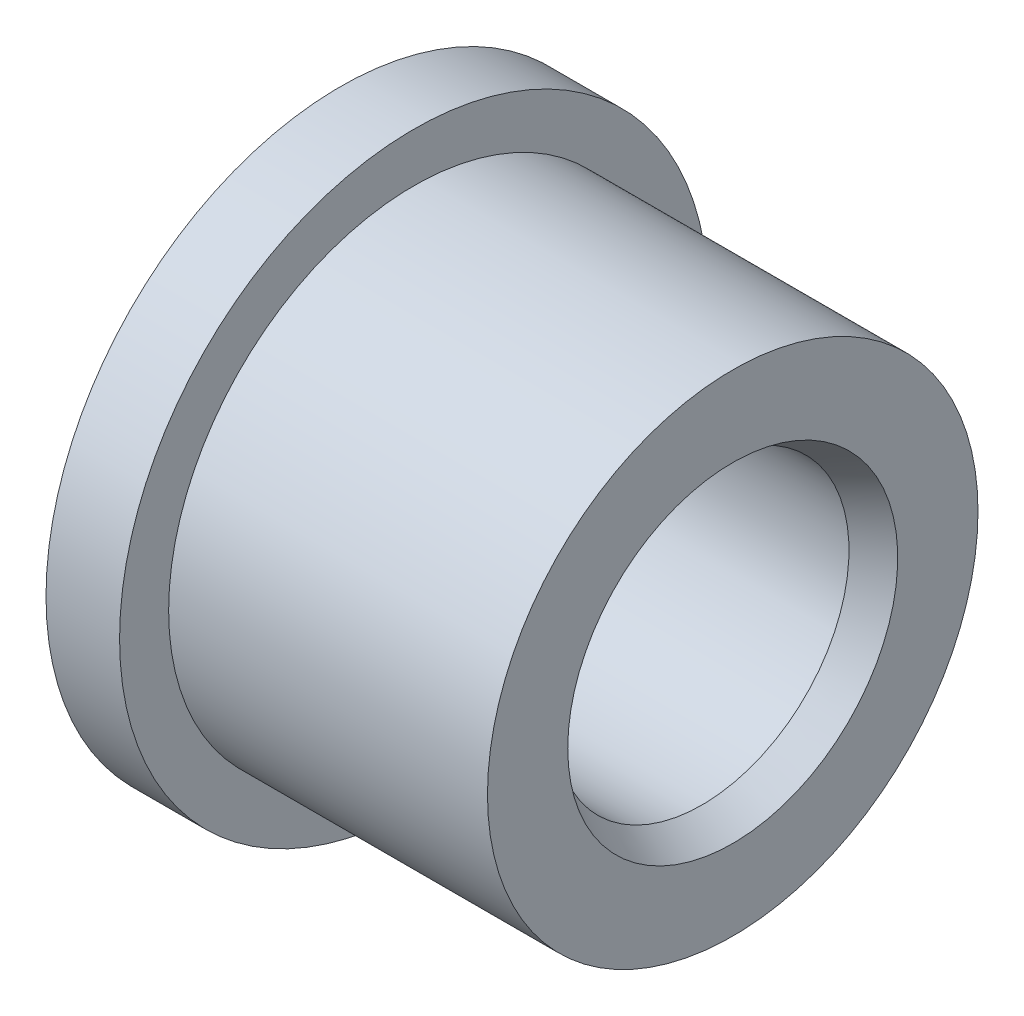
ISO-10303-21;
HEADER;
FILE_DESCRIPTION(('STEP AP214'),'2;1');
FILE_NAME('part.step','',(''),(''),'','','');
FILE_SCHEMA(('AUTOMOTIVE_DESIGN { 1 0 10303 214 1 1 1 1 }'));
ENDSEC;
DATA;
#1=APPLICATION_CONTEXT('core data for automotive mechanical design processes');
#2=APPLICATION_PROTOCOL_DEFINITION('international standard','automotive_design',2000,#1);
#3=PRODUCT_CONTEXT('',#1,'mechanical');
#4=PRODUCT('Part','Part','',(#3));
#5=PRODUCT_RELATED_PRODUCT_CATEGORY('part','',(#4));
#6=PRODUCT_DEFINITION_FORMATION('','',#4);
#7=PRODUCT_DEFINITION_CONTEXT('part definition',#1,'design');
#8=PRODUCT_DEFINITION('design','',#6,#7);
#9=PRODUCT_DEFINITION_SHAPE('','',#8);
#10=(LENGTH_UNIT() NAMED_UNIT(*) SI_UNIT(.MILLI.,.METRE.));
#11=(NAMED_UNIT(*) PLANE_ANGLE_UNIT() SI_UNIT($,.RADIAN.));
#12=(NAMED_UNIT(*) SI_UNIT($,.STERADIAN.) SOLID_ANGLE_UNIT());
#13=UNCERTAINTY_MEASURE_WITH_UNIT(LENGTH_MEASURE(1.E-05),#10,'distance_accuracy_value','');
#14=(GEOMETRIC_REPRESENTATION_CONTEXT(3) GLOBAL_UNCERTAINTY_ASSIGNED_CONTEXT((#13)) GLOBAL_UNIT_ASSIGNED_CONTEXT((#10,
#11,#12)) REPRESENTATION_CONTEXT('',''));
#15=CARTESIAN_POINT('',(0.,0.,0.));
#16=DIRECTION('',(0.,0.,1.));
#17=DIRECTION('',(1.,0.,0.));
#18=AXIS2_PLACEMENT_3D('',#15,#16,#17);
#19=CARTESIAN_POINT('',(0.,0.,0.));
#20=DIRECTION('',(-1.,0.,0.));
#21=DIRECTION('',(0.,0.,1.));
#22=AXIS2_PLACEMENT_3D('',#19,#20,#21);
#23=CYLINDRICAL_SURFACE('',#22,2.38125);
#24=CARTESIAN_POINT('',(5.85,0.,0.));
#25=DIRECTION('',(-1.,0.,0.));
#26=DIRECTION('',(0.,0.,1.));
#27=AXIS2_PLACEMENT_3D('',#24,#25,#26);
#28=CIRCLE('',#27,2.38125);
#29=CARTESIAN_POINT('',(5.85,0.,2.38125));
#30=VERTEX_POINT('',#29);
#31=EDGE_CURVE('E37',#30,#30,#28,.F.);
#32=ORIENTED_EDGE('',*,*,#31,.T.);
#33=EDGE_LOOP('',(#32));
#34=FACE_BOUND('',#33,.T.);
#35=CARTESIAN_POINT('',(0.288675134594813,0.,0.));
#36=DIRECTION('',(1.,0.,0.));
#37=DIRECTION('',(0.,0.,-1.));
#38=AXIS2_PLACEMENT_3D('',#35,#36,#37);
#39=CIRCLE('',#38,2.38125);
#40=CARTESIAN_POINT('',(0.288675134594813,0.,-2.38125));
#41=VERTEX_POINT('',#40);
#42=EDGE_CURVE('E41',#41,#41,#39,.F.);
#43=ORIENTED_EDGE('',*,*,#42,.T.);
#44=EDGE_LOOP('',(#43));
#45=FACE_BOUND('',#44,.T.);
#46=ADVANCED_FACE('F30',(#34,#45),#23,.F.);
#47=CARTESIAN_POINT('',(0.,2.38125,0.));
#48=DIRECTION('',(1.,0.,0.));
#49=DIRECTION('',(0.,0.,-1.));
#50=AXIS2_PLACEMENT_3D('',#47,#48,#49);
#51=PLANE('',#50);
#52=CARTESIAN_POINT('',(0.,0.,0.));
#53=DIRECTION('',(1.,0.,0.));
#54=DIRECTION('',(0.,0.,-1.));
#55=AXIS2_PLACEMENT_3D('',#52,#53,#54);
#56=CIRCLE('',#55,2.88125);
#57=CARTESIAN_POINT('',(0.,0.,-2.88125));
#58=VERTEX_POINT('',#57);
#59=EDGE_CURVE('E10',#58,#58,#56,.T.);
#60=ORIENTED_EDGE('',*,*,#59,.T.);
#61=EDGE_LOOP('',(#60));
#62=FACE_BOUND('',#61,.T.);
#63=CARTESIAN_POINT('',(0.,0.,0.));
#64=DIRECTION('',(-1.,0.,0.));
#65=DIRECTION('',(0.,0.,1.));
#66=AXIS2_PLACEMENT_3D('',#63,#64,#65);
#67=CIRCLE('',#66,4.7625);
#68=CARTESIAN_POINT('',(0.,0.,4.7625));
#69=VERTEX_POINT('',#68);
#70=EDGE_CURVE('E50',#69,#69,#67,.T.);
#71=ORIENTED_EDGE('',*,*,#70,.T.);
#72=EDGE_LOOP('',(#71));
#73=FACE_BOUND('',#72,.T.);
#74=ADVANCED_FACE('F79',(#62,#73),#51,.F.);
#75=CARTESIAN_POINT('',(0.,0.,0.));
#76=DIRECTION('',(-1.,0.,0.));
#77=DIRECTION('',(0.,0.,1.));
#78=AXIS2_PLACEMENT_3D('',#75,#76,#77);
#79=CYLINDRICAL_SURFACE('',#78,4.7625);
#80=ORIENTED_EDGE('',*,*,#70,.F.);
#81=EDGE_LOOP('',(#80));
#82=FACE_BOUND('',#81,.T.);
#83=CARTESIAN_POINT('',(1.190625,0.,0.));
#84=DIRECTION('',(-1.,0.,0.));
#85=DIRECTION('',(0.,0.,1.));
#86=AXIS2_PLACEMENT_3D('',#83,#84,#85);
#87=CIRCLE('',#86,4.7625);
#88=CARTESIAN_POINT('',(1.190625,0.,4.7625));
#89=VERTEX_POINT('',#88);
#90=EDGE_CURVE('E53',#89,#89,#87,.T.);
#91=ORIENTED_EDGE('',*,*,#90,.T.);
#92=EDGE_LOOP('',(#91));
#93=FACE_BOUND('',#92,.T.);
#94=ADVANCED_FACE('F84',(#82,#93),#79,.T.);
#95=CARTESIAN_POINT('',(1.190625,4.7625,0.));
#96=DIRECTION('',(-1.,0.,0.));
#97=DIRECTION('',(0.,0.,1.));
#98=AXIS2_PLACEMENT_3D('',#95,#96,#97);
#99=PLANE('',#98);
#100=ORIENTED_EDGE('',*,*,#90,.F.);
#101=EDGE_LOOP('',(#100));
#102=FACE_BOUND('',#101,.T.);
#103=CARTESIAN_POINT('',(1.190625,0.,0.));
#104=DIRECTION('',(-1.,0.,0.));
#105=DIRECTION('',(0.,0.,1.));
#106=AXIS2_PLACEMENT_3D('',#103,#104,#105);
#107=CIRCLE('',#106,3.96875);
#108=CARTESIAN_POINT('',(1.190625,0.,3.96875));
#109=VERTEX_POINT('',#108);
#110=EDGE_CURVE('E56',#109,#109,#107,.T.);
#111=ORIENTED_EDGE('',*,*,#110,.T.);
#112=EDGE_LOOP('',(#111));
#113=FACE_BOUND('',#112,.T.);
#114=ADVANCED_FACE('F75',(#102,#113),#99,.F.);
#115=CARTESIAN_POINT('',(0.,0.,0.));
#116=DIRECTION('',(-1.,0.,0.));
#117=DIRECTION('',(0.,0.,1.));
#118=AXIS2_PLACEMENT_3D('',#115,#116,#117);
#119=CYLINDRICAL_SURFACE('',#118,3.96875);
#120=ORIENTED_EDGE('',*,*,#110,.F.);
#121=EDGE_LOOP('',(#120));
#122=FACE_BOUND('',#121,.T.);
#123=CARTESIAN_POINT('',(6.35,0.,0.));
#124=DIRECTION('',(-1.,0.,0.));
#125=DIRECTION('',(0.,0.,1.));
#126=AXIS2_PLACEMENT_3D('',#123,#124,#125);
#127=CIRCLE('',#126,3.96875);
#128=CARTESIAN_POINT('',(6.35,0.,3.96875));
#129=VERTEX_POINT('',#128);
#130=EDGE_CURVE('E59',#129,#129,#127,.T.);
#131=ORIENTED_EDGE('',*,*,#130,.T.);
#132=EDGE_LOOP('',(#131));
#133=FACE_BOUND('',#132,.T.);
#134=ADVANCED_FACE('F63',(#122,#133),#119,.T.);
#135=CARTESIAN_POINT('',(6.35,3.96875,0.));
#136=DIRECTION('',(-1.,0.,0.));
#137=DIRECTION('',(0.,0.,1.));
#138=AXIS2_PLACEMENT_3D('',#135,#136,#137);
#139=PLANE('',#138);
#140=CARTESIAN_POINT('',(6.35,0.,0.));
#141=DIRECTION('',(-1.,0.,0.));
#142=DIRECTION('',(0.,0.,1.));
#143=AXIS2_PLACEMENT_3D('',#140,#141,#142);
#144=CIRCLE('',#143,2.66992513459481);
#145=CARTESIAN_POINT('',(6.35,0.,2.66992513459481));
#146=VERTEX_POINT('',#145);
#147=EDGE_CURVE('E45',#146,#146,#144,.T.);
#148=ORIENTED_EDGE('',*,*,#147,.T.);
#149=EDGE_LOOP('',(#148));
#150=FACE_BOUND('',#149,.T.);
#151=ORIENTED_EDGE('',*,*,#130,.F.);
#152=EDGE_LOOP('',(#151));
#153=FACE_BOUND('',#152,.T.);
#154=ADVANCED_FACE('F65',(#150,#153),#139,.F.);
#155=CARTESIAN_POINT('',(6.35,0.,0.));
#156=DIRECTION('',(1.,0.,0.));
#157=DIRECTION('',(0.,0.,-1.));
#158=AXIS2_PLACEMENT_3D('',#155,#156,#157);
#159=CONICAL_SURFACE('',#158,2.66992513459481,0.523598775598297);
#160=ORIENTED_EDGE('',*,*,#31,.F.);
#161=EDGE_LOOP('',(#160));
#162=FACE_BOUND('',#161,.T.);
#163=ORIENTED_EDGE('',*,*,#147,.F.);
#164=EDGE_LOOP('',(#163));
#165=FACE_BOUND('',#164,.T.);
#166=ADVANCED_FACE('F67',(#162,#165),#159,.F.);
#167=CARTESIAN_POINT('',(0.288675134594813,0.,0.));
#168=DIRECTION('',(-1.,0.,0.));
#169=DIRECTION('',(0.,0.,1.));
#170=AXIS2_PLACEMENT_3D('',#167,#168,#169);
#171=CONICAL_SURFACE('',#170,2.38125,1.0471975511966);
#172=ORIENTED_EDGE('',*,*,#59,.F.);
#173=EDGE_LOOP('',(#172));
#174=FACE_BOUND('',#173,.T.);
#175=ORIENTED_EDGE('',*,*,#42,.F.);
#176=EDGE_LOOP('',(#175));
#177=FACE_BOUND('',#176,.T.);
#178=ADVANCED_FACE('F32',(#174,#177),#171,.F.);
#179=CLOSED_SHELL('',(#46,#74,#94,#114,#134,#154,#166,#178));
#180=MANIFOLD_SOLID_BREP('B2',#179);
#181=ADVANCED_BREP_SHAPE_REPRESENTATION('',(#18,#180),#14);
#182=SHAPE_DEFINITION_REPRESENTATION(#9,#181);
ENDSEC;
END-ISO-10303-21;
